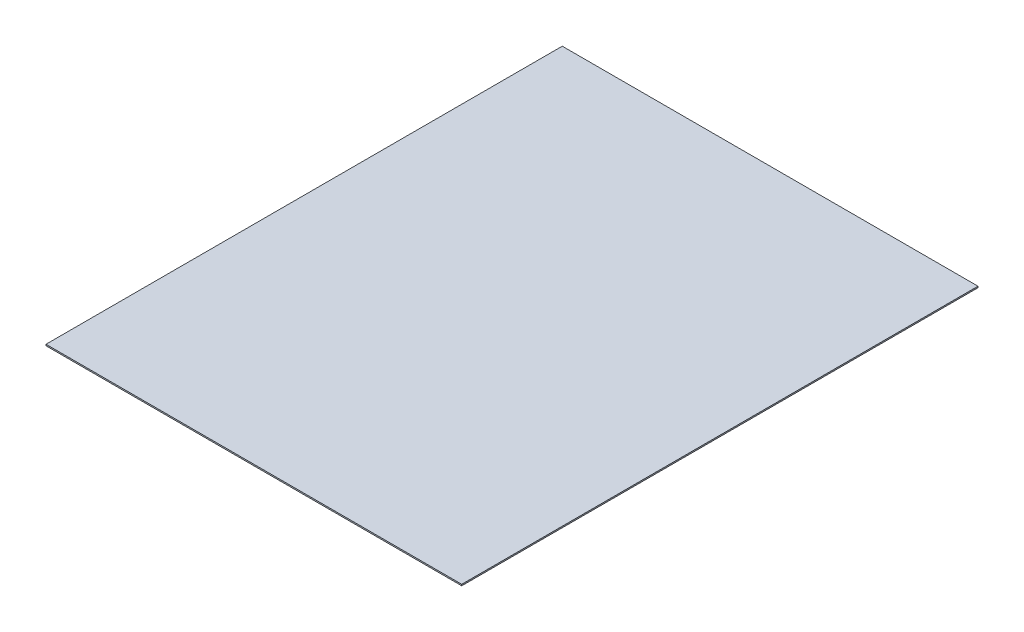
ISO-10303-21;
HEADER;
FILE_DESCRIPTION(('STEP AP214'),'2;1');
FILE_NAME('part.step','',(''),(''),'','','');
FILE_SCHEMA(('AUTOMOTIVE_DESIGN { 1 0 10303 214 1 1 1 1 }'));
ENDSEC;
DATA;
#1=APPLICATION_CONTEXT('core data for automotive mechanical design processes');
#2=APPLICATION_PROTOCOL_DEFINITION('international standard','automotive_design',2000,#1);
#3=PRODUCT_CONTEXT('',#1,'mechanical');
#4=PRODUCT('Part','Part','',(#3));
#5=PRODUCT_RELATED_PRODUCT_CATEGORY('part','',(#4));
#6=PRODUCT_DEFINITION_FORMATION('','',#4);
#7=PRODUCT_DEFINITION_CONTEXT('part definition',#1,'design');
#8=PRODUCT_DEFINITION('design','',#6,#7);
#9=PRODUCT_DEFINITION_SHAPE('','',#8);
#10=(LENGTH_UNIT() NAMED_UNIT(*) SI_UNIT(.MILLI.,.METRE.));
#11=(NAMED_UNIT(*) PLANE_ANGLE_UNIT() SI_UNIT($,.RADIAN.));
#12=(NAMED_UNIT(*) SI_UNIT($,.STERADIAN.) SOLID_ANGLE_UNIT());
#13=UNCERTAINTY_MEASURE_WITH_UNIT(LENGTH_MEASURE(1.E-05),#10,'distance_accuracy_value','');
#14=(GEOMETRIC_REPRESENTATION_CONTEXT(3) GLOBAL_UNCERTAINTY_ASSIGNED_CONTEXT((#13)) GLOBAL_UNIT_ASSIGNED_CONTEXT((#10,
#11,#12)) REPRESENTATION_CONTEXT('',''));
#15=CARTESIAN_POINT('',(0.,0.,0.));
#16=DIRECTION('',(0.,0.,1.));
#17=DIRECTION('',(1.,0.,0.));
#18=AXIS2_PLACEMENT_3D('',#15,#16,#17);
#19=CARTESIAN_POINT('',(-348.152577928548,1.,209.84451150979));
#20=DIRECTION('',(1.,0.,0.));
#21=DIRECTION('',(0.,0.,-1.));
#22=AXIS2_PLACEMENT_3D('',#19,#20,#21);
#23=PLANE('',#22);
#24=DIRECTION('',(0.,0.,1.));
#25=VECTOR('',#24,1.);
#26=CARTESIAN_POINT('',(-348.152577928548,0.,209.84451150979));
#27=LINE('',#26,#25);
#28=CARTESIAN_POINT('',(-348.152577928551,0.,-170.15548849021));
#29=VERTEX_POINT('',#28);
#30=CARTESIAN_POINT('',(-348.152577928548,0.,209.84451150979));
#31=VERTEX_POINT('',#30);
#32=EDGE_CURVE('E97',#29,#31,#27,.T.);
#33=ORIENTED_EDGE('',*,*,#32,.T.);
#34=DIRECTION('',(0.,-1.,0.));
#35=VECTOR('',#34,1.);
#36=CARTESIAN_POINT('',(-348.152577928548,1.,209.84451150979));
#37=LINE('',#36,#35);
#38=CARTESIAN_POINT('',(-348.152577928548,1.,209.84451150979));
#39=VERTEX_POINT('',#38);
#40=EDGE_CURVE('E11',#39,#31,#37,.T.);
#41=ORIENTED_EDGE('',*,*,#40,.F.);
#42=DIRECTION('',(0.,0.,1.));
#43=VECTOR('',#42,1.);
#44=CARTESIAN_POINT('',(-348.152577928548,1.,209.84451150979));
#45=LINE('',#44,#43);
#46=CARTESIAN_POINT('',(-348.152577928551,1.,-170.15548849021));
#47=VERTEX_POINT('',#46);
#48=EDGE_CURVE('E85',#47,#39,#45,.T.);
#49=ORIENTED_EDGE('',*,*,#48,.F.);
#50=DIRECTION('',(0.,-1.,0.));
#51=VECTOR('',#50,1.);
#52=CARTESIAN_POINT('',(-348.152577928551,1.,-170.15548849021));
#53=LINE('',#52,#51);
#54=EDGE_CURVE('E93',#47,#29,#53,.T.);
#55=ORIENTED_EDGE('',*,*,#54,.T.);
#56=EDGE_LOOP('',(#33,#41,#49,#55));
#57=FACE_BOUND('',#56,.T.);
#58=ADVANCED_FACE('F34',(#57),#23,.F.);
#59=CARTESIAN_POINT('',(-348.152577928548,1.,209.84451150979));
#60=DIRECTION('',(0.,0.,-1.));
#61=DIRECTION('',(-1.,0.,0.));
#62=AXIS2_PLACEMENT_3D('',#59,#60,#61);
#63=PLANE('',#62);
#64=DIRECTION('',(1.,0.,0.));
#65=VECTOR('',#64,1.);
#66=CARTESIAN_POINT('',(-348.152577928548,0.,209.84451150979));
#67=LINE('',#66,#65);
#68=CARTESIAN_POINT('',(-42.1525779285479,0.,209.844511509787));
#69=VERTEX_POINT('',#68);
#70=EDGE_CURVE('E89',#31,#69,#67,.T.);
#71=ORIENTED_EDGE('',*,*,#70,.T.);
#72=DIRECTION('',(0.,-1.,0.));
#73=VECTOR('',#72,1.);
#74=CARTESIAN_POINT('',(-42.1525779285479,1.,209.844511509787));
#75=LINE('',#74,#73);
#76=CARTESIAN_POINT('',(-42.1525779285479,1.,209.844511509787));
#77=VERTEX_POINT('',#76);
#78=EDGE_CURVE('E42',#77,#69,#75,.T.);
#79=ORIENTED_EDGE('',*,*,#78,.F.);
#80=DIRECTION('',(1.,0.,0.));
#81=VECTOR('',#80,1.);
#82=CARTESIAN_POINT('',(-348.152577928548,1.,209.84451150979));
#83=LINE('',#82,#81);
#84=EDGE_CURVE('E80',#39,#77,#83,.T.);
#85=ORIENTED_EDGE('',*,*,#84,.F.);
#86=ORIENTED_EDGE('',*,*,#40,.T.);
#87=EDGE_LOOP('',(#71,#79,#85,#86));
#88=FACE_BOUND('',#87,.T.);
#89=ADVANCED_FACE('F88',(#88),#63,.F.);
#90=CARTESIAN_POINT('',(-42.1525779285479,1.,209.844511509787));
#91=DIRECTION('',(-1.,0.,0.));
#92=DIRECTION('',(0.,0.,1.));
#93=AXIS2_PLACEMENT_3D('',#90,#91,#92);
#94=PLANE('',#93);
#95=DIRECTION('',(0.,0.,-1.));
#96=VECTOR('',#95,1.);
#97=CARTESIAN_POINT('',(-42.1525779285479,0.,209.844511509787));
#98=LINE('',#97,#96);
#99=CARTESIAN_POINT('',(-42.1525779285505,0.,-170.155488490213));
#100=VERTEX_POINT('',#99);
#101=EDGE_CURVE('E67',#69,#100,#98,.T.);
#102=ORIENTED_EDGE('',*,*,#101,.T.);
#103=DIRECTION('',(0.,-1.,0.));
#104=VECTOR('',#103,1.);
#105=CARTESIAN_POINT('',(-42.1525779285505,1.,-170.155488490213));
#106=LINE('',#105,#104);
#107=CARTESIAN_POINT('',(-42.1525779285505,1.,-170.155488490213));
#108=VERTEX_POINT('',#107);
#109=EDGE_CURVE('E90',#108,#100,#106,.T.);
#110=ORIENTED_EDGE('',*,*,#109,.F.);
#111=DIRECTION('',(0.,0.,-1.));
#112=VECTOR('',#111,1.);
#113=CARTESIAN_POINT('',(-42.1525779285479,1.,209.844511509787));
#114=LINE('',#113,#112);
#115=EDGE_CURVE('E83',#77,#108,#114,.T.);
#116=ORIENTED_EDGE('',*,*,#115,.F.);
#117=ORIENTED_EDGE('',*,*,#78,.T.);
#118=EDGE_LOOP('',(#102,#110,#116,#117));
#119=FACE_BOUND('',#118,.T.);
#120=ADVANCED_FACE('F91',(#119),#94,.F.);
#121=CARTESIAN_POINT('',(-348.152577928551,1.,-170.15548849021));
#122=DIRECTION('',(0.,0.,1.));
#123=DIRECTION('',(1.,0.,0.));
#124=AXIS2_PLACEMENT_3D('',#121,#122,#123);
#125=PLANE('',#124);
#126=DIRECTION('',(-1.,0.,0.));
#127=VECTOR('',#126,1.);
#128=CARTESIAN_POINT('',(-348.152577928551,0.,-170.15548849021));
#129=LINE('',#128,#127);
#130=EDGE_CURVE('E73',#100,#29,#129,.T.);
#131=ORIENTED_EDGE('',*,*,#130,.T.);
#132=ORIENTED_EDGE('',*,*,#54,.F.);
#133=DIRECTION('',(-1.,0.,0.));
#134=VECTOR('',#133,1.);
#135=CARTESIAN_POINT('',(-348.152577928551,1.,-170.15548849021));
#136=LINE('',#135,#134);
#137=EDGE_CURVE('E50',#108,#47,#136,.T.);
#138=ORIENTED_EDGE('',*,*,#137,.F.);
#139=ORIENTED_EDGE('',*,*,#109,.T.);
#140=EDGE_LOOP('',(#131,#132,#138,#139));
#141=FACE_BOUND('',#140,.T.);
#142=ADVANCED_FACE('F104',(#141),#125,.F.);
#143=CARTESIAN_POINT('',(0.,1.,0.));
#144=DIRECTION('',(0.,-1.,0.));
#145=DIRECTION('',(0.,0.,-1.));
#146=AXIS2_PLACEMENT_3D('',#143,#144,#145);
#147=PLANE('',#146);
#148=ORIENTED_EDGE('',*,*,#48,.T.);
#149=ORIENTED_EDGE('',*,*,#84,.T.);
#150=ORIENTED_EDGE('',*,*,#115,.T.);
#151=ORIENTED_EDGE('',*,*,#137,.T.);
#152=EDGE_LOOP('',(#148,#149,#150,#151));
#153=FACE_BOUND('',#152,.T.);
#154=ADVANCED_FACE('F81',(#153),#147,.F.);
#155=CARTESIAN_POINT('',(0.,0.,0.));
#156=DIRECTION('',(0.,-1.,0.));
#157=DIRECTION('',(0.,0.,-1.));
#158=AXIS2_PLACEMENT_3D('',#155,#156,#157);
#159=PLANE('',#158);
#160=ORIENTED_EDGE('',*,*,#32,.F.);
#161=ORIENTED_EDGE('',*,*,#130,.F.);
#162=ORIENTED_EDGE('',*,*,#101,.F.);
#163=ORIENTED_EDGE('',*,*,#70,.F.);
#164=EDGE_LOOP('',(#160,#161,#162,#163));
#165=FACE_BOUND('',#164,.T.);
#166=ADVANCED_FACE('F107',(#165),#159,.T.);
#167=CLOSED_SHELL('',(#58,#89,#120,#142,#154,#166));
#168=MANIFOLD_SOLID_BREP('B2',#167);
#169=ADVANCED_BREP_SHAPE_REPRESENTATION('',(#18,#168),#14);
#170=SHAPE_DEFINITION_REPRESENTATION(#9,#169);
ENDSEC;
END-ISO-10303-21;
